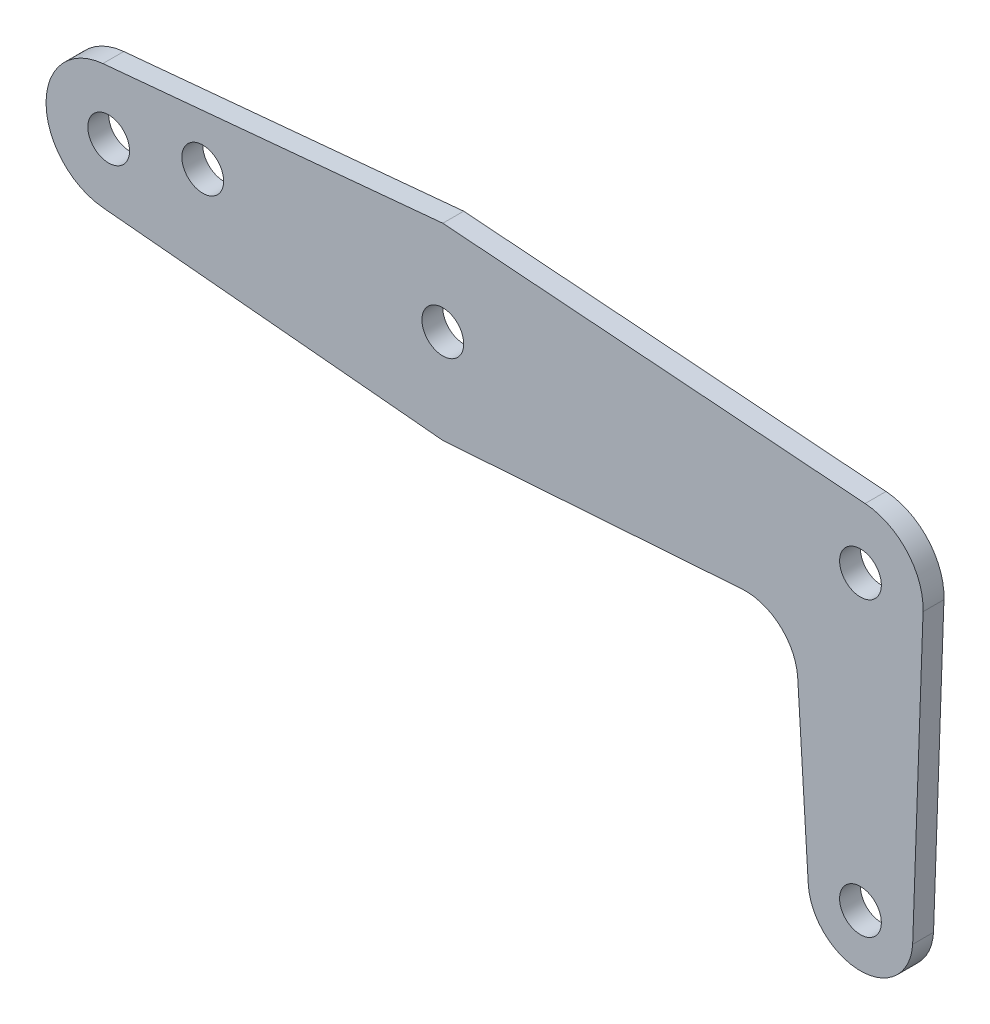
ISO-10303-21;
HEADER;
FILE_DESCRIPTION(('STEP AP214'),'2;1');
FILE_NAME('part.step','',(''),(''),'','','');
FILE_SCHEMA(('AUTOMOTIVE_DESIGN { 1 0 10303 214 1 1 1 1 }'));
ENDSEC;
DATA;
#1=APPLICATION_CONTEXT('core data for automotive mechanical design processes');
#2=APPLICATION_PROTOCOL_DEFINITION('international standard','automotive_design',2000,#1);
#3=PRODUCT_CONTEXT('',#1,'mechanical');
#4=PRODUCT('Part','Part','',(#3));
#5=PRODUCT_RELATED_PRODUCT_CATEGORY('part','',(#4));
#6=PRODUCT_DEFINITION_FORMATION('','',#4);
#7=PRODUCT_DEFINITION_CONTEXT('part definition',#1,'design');
#8=PRODUCT_DEFINITION('design','',#6,#7);
#9=PRODUCT_DEFINITION_SHAPE('','',#8);
#10=(LENGTH_UNIT() NAMED_UNIT(*) SI_UNIT(.MILLI.,.METRE.));
#11=(NAMED_UNIT(*) PLANE_ANGLE_UNIT() SI_UNIT($,.RADIAN.));
#12=(NAMED_UNIT(*) SI_UNIT($,.STERADIAN.) SOLID_ANGLE_UNIT());
#13=UNCERTAINTY_MEASURE_WITH_UNIT(LENGTH_MEASURE(1.E-05),#10,'distance_accuracy_value','');
#14=(GEOMETRIC_REPRESENTATION_CONTEXT(3) GLOBAL_UNCERTAINTY_ASSIGNED_CONTEXT((#13)) GLOBAL_UNIT_ASSIGNED_CONTEXT((#10,
#11,#12)) REPRESENTATION_CONTEXT('',''));
#15=CARTESIAN_POINT('',(0.,0.,0.));
#16=DIRECTION('',(0.,0.,1.));
#17=DIRECTION('',(1.,0.,0.));
#18=AXIS2_PLACEMENT_3D('',#15,#16,#17);
#19=CARTESIAN_POINT('',(-45.,0.,1.25));
#20=DIRECTION('',(0.,0.,1.));
#21=DIRECTION('',(1.,0.,0.));
#22=AXIS2_PLACEMENT_3D('',#19,#20,#21);
#23=PLANE('',#22);
#24=CARTESIAN_POINT('',(-25.,0.,1.25));
#25=DIRECTION('',(0.,0.,1.));
#26=DIRECTION('',(1.,0.,0.));
#27=AXIS2_PLACEMENT_3D('',#24,#25,#26);
#28=CIRCLE('',#27,1.25);
#29=CARTESIAN_POINT('',(-23.75,0.,1.25));
#30=VERTEX_POINT('',#29);
#31=EDGE_CURVE('E265',#30,#30,#28,.T.);
#32=ORIENTED_EDGE('',*,*,#31,.F.);
#33=EDGE_LOOP('',(#32));
#34=FACE_BOUND('',#33,.T.);
#35=CARTESIAN_POINT('',(0.,-17.5,1.25));
#36=DIRECTION('',(0.,0.,1.));
#37=DIRECTION('',(1.,0.,0.));
#38=AXIS2_PLACEMENT_3D('',#35,#36,#37);
#39=CIRCLE('',#38,1.25);
#40=CARTESIAN_POINT('',(1.25,-17.5,1.25));
#41=VERTEX_POINT('',#40);
#42=EDGE_CURVE('E249',#41,#41,#39,.T.);
#43=ORIENTED_EDGE('',*,*,#42,.F.);
#44=EDGE_LOOP('',(#43));
#45=FACE_BOUND('',#44,.T.);
#46=DIRECTION('',(-0.995686107734085,-0.0927856393271451,0.));
#47=VECTOR('',#46,1.);
#48=CARTESIAN_POINT('',(-25.,5.63,1.25));
#49=LINE('',#48,#47);
#50=CARTESIAN_POINT('',(-25.,5.63,1.25));
#51=VERTEX_POINT('',#50);
#52=CARTESIAN_POINT('',(-45.3479461474768,3.73382290400282,1.25));
#53=VERTEX_POINT('',#52);
#54=EDGE_CURVE('E182',#51,#53,#49,.T.);
#55=ORIENTED_EDGE('',*,*,#54,.T.);
#56=CARTESIAN_POINT('',(-45.,0.,1.25));
#57=DIRECTION('',(0.,0.,1.));
#58=DIRECTION('',(1.,0.,0.));
#59=AXIS2_PLACEMENT_3D('',#56,#57,#58);
#60=CIRCLE('',#59,3.75);
#61=CARTESIAN_POINT('',(-45.3479461474768,-3.73382290400282,1.25));
#62=VERTEX_POINT('',#61);
#63=EDGE_CURVE('E106',#53,#62,#60,.T.);
#64=ORIENTED_EDGE('',*,*,#63,.T.);
#65=DIRECTION('',(0.995686107734085,-0.0927856393271451,0.));
#66=VECTOR('',#65,1.);
#67=CARTESIAN_POINT('',(-25.,-5.63,1.25));
#68=LINE('',#67,#66);
#69=CARTESIAN_POINT('',(-25.,-5.63,1.25));
#70=VERTEX_POINT('',#69);
#71=EDGE_CURVE('E211',#62,#70,#68,.T.);
#72=ORIENTED_EDGE('',*,*,#71,.T.);
#73=DIRECTION('',(0.99756184215865,0.0697880438831856,0.));
#74=VECTOR('',#73,1.);
#75=CARTESIAN_POINT('',(-7.09843657735437,-4.37763143404343,1.25));
#76=LINE('',#75,#74);
#77=CARTESIAN_POINT('',(-7.09843657735437,-4.37763143404343,1.25));
#78=VERTEX_POINT('',#77);
#79=EDGE_CURVE('E231',#70,#78,#76,.T.);
#80=ORIENTED_EDGE('',*,*,#79,.T.);
#81=CARTESIAN_POINT('',(-6.88,-7.5,1.25));
#82=DIRECTION('',(0.,0.,-1.));
#83=DIRECTION('',(1.,0.,0.));
#84=AXIS2_PLACEMENT_3D('',#81,#82,#83);
#85=CIRCLE('',#84,3.13);
#86=CARTESIAN_POINT('',(-3.75577727989944,-7.30991476857082,1.25));
#87=VERTEX_POINT('',#86);
#88=EDGE_CURVE('E227',#78,#87,#85,.T.);
#89=ORIENTED_EDGE('',*,*,#88,.T.);
#90=DIRECTION('',(0.0607301058879179,-0.998154223674299,0.));
#91=VECTOR('',#90,1.);
#92=CARTESIAN_POINT('',(-3.12422272010055,-17.6900852314292,1.25));
#93=LINE('',#92,#91);
#94=CARTESIAN_POINT('',(-3.12422272010055,-17.6900852314292,1.25));
#95=VERTEX_POINT('',#94);
#96=EDGE_CURVE('E230',#87,#95,#93,.T.);
#97=ORIENTED_EDGE('',*,*,#96,.T.);
#98=CARTESIAN_POINT('',(0.,-17.5,1.25));
#99=DIRECTION('',(0.,0.,1.));
#100=DIRECTION('',(1.,0.,0.));
#101=AXIS2_PLACEMENT_3D('',#98,#99,#100);
#102=CIRCLE('',#101,3.13);
#103=CARTESIAN_POINT('',(3.12422272010056,-17.6900852314292,1.25));
#104=VERTEX_POINT('',#103);
#105=EDGE_CURVE('E131',#95,#104,#102,.T.);
#106=ORIENTED_EDGE('',*,*,#105,.T.);
#107=DIRECTION('',(0.0354856947205219,0.999370184401257,0.));
#108=VECTOR('',#107,1.);
#109=CARTESIAN_POINT('',(3.12422272010056,-17.6900852314292,1.25));
#110=LINE('',#109,#108);
#111=CARTESIAN_POINT('',(3.74763819150471,-0.133071355201956,1.25));
#112=VERTEX_POINT('',#111);
#113=EDGE_CURVE('E125',#104,#112,#110,.T.);
#114=ORIENTED_EDGE('',*,*,#113,.T.);
#115=CARTESIAN_POINT('',(0.,0.,1.25));
#116=DIRECTION('',(0.,0.,1.));
#117=DIRECTION('',(-1.,0.,0.));
#118=AXIS2_PLACEMENT_3D('',#115,#116,#117);
#119=CIRCLE('',#118,3.75);
#120=CARTESIAN_POINT('',(0.279648541627755,3.73955835536303,1.25));
#121=VERTEX_POINT('',#120);
#122=EDGE_CURVE('E129',#112,#121,#119,.T.);
#123=ORIENTED_EDGE('',*,*,#122,.T.);
#124=DIRECTION('',(-0.997215561430142,0.074572944434068,0.));
#125=VECTOR('',#124,1.);
#126=CARTESIAN_POINT('',(0.279648541627755,3.73955835536303,1.25));
#127=LINE('',#126,#125);
#128=EDGE_CURVE('E57',#121,#51,#127,.T.);
#129=ORIENTED_EDGE('',*,*,#128,.T.);
#130=EDGE_LOOP('',(#55,#64,#72,#80,#89,#97,#106,#114,#123,#129));
#131=FACE_BOUND('',#130,.T.);
#132=CARTESIAN_POINT('',(0.,0.,1.25));
#133=DIRECTION('',(0.,0.,1.));
#134=DIRECTION('',(1.,0.,0.));
#135=AXIS2_PLACEMENT_3D('',#132,#133,#134);
#136=CIRCLE('',#135,1.25);
#137=CARTESIAN_POINT('',(1.25,0.,1.25));
#138=VERTEX_POINT('',#137);
#139=EDGE_CURVE('E158',#138,#138,#136,.T.);
#140=ORIENTED_EDGE('',*,*,#139,.F.);
#141=EDGE_LOOP('',(#140));
#142=FACE_BOUND('',#141,.T.);
#143=CARTESIAN_POINT('',(-45.,0.,1.25));
#144=DIRECTION('',(0.,0.,1.));
#145=DIRECTION('',(1.,0.,0.));
#146=AXIS2_PLACEMENT_3D('',#143,#144,#145);
#147=CIRCLE('',#146,1.25);
#148=CARTESIAN_POINT('',(-43.75,0.,1.25));
#149=VERTEX_POINT('',#148);
#150=EDGE_CURVE('E257',#149,#149,#147,.T.);
#151=ORIENTED_EDGE('',*,*,#150,.F.);
#152=EDGE_LOOP('',(#151));
#153=FACE_BOUND('',#152,.T.);
#154=CARTESIAN_POINT('',(-39.37,1.25,1.25));
#155=DIRECTION('',(0.,0.,1.));
#156=DIRECTION('',(1.,0.,0.));
#157=AXIS2_PLACEMENT_3D('',#154,#155,#156);
#158=CIRCLE('',#157,1.25);
#159=CARTESIAN_POINT('',(-38.12,1.25,1.25));
#160=VERTEX_POINT('',#159);
#161=EDGE_CURVE('E273',#160,#160,#158,.T.);
#162=ORIENTED_EDGE('',*,*,#161,.F.);
#163=EDGE_LOOP('',(#162));
#164=FACE_BOUND('',#163,.T.);
#165=ADVANCED_FACE('F39',(#34,#45,#131,#142,#153,#164),#23,.T.);
#166=CARTESIAN_POINT('',(-45.,0.,0.));
#167=DIRECTION('',(0.,0.,1.));
#168=DIRECTION('',(1.,0.,0.));
#169=AXIS2_PLACEMENT_3D('',#166,#167,#168);
#170=PLANE('',#169);
#171=DIRECTION('',(-0.995686107734085,-0.0927856393271451,0.));
#172=VECTOR('',#171,1.);
#173=CARTESIAN_POINT('',(-25.,5.63,0.));
#174=LINE('',#173,#172);
#175=CARTESIAN_POINT('',(-25.,5.63,0.));
#176=VERTEX_POINT('',#175);
#177=CARTESIAN_POINT('',(-45.3479461474768,3.73382290400282,0.));
#178=VERTEX_POINT('',#177);
#179=EDGE_CURVE('E153',#176,#178,#174,.T.);
#180=ORIENTED_EDGE('',*,*,#179,.F.);
#181=DIRECTION('',(-0.997215561430142,0.074572944434068,0.));
#182=VECTOR('',#181,1.);
#183=CARTESIAN_POINT('',(0.279648541627755,3.73955835536303,0.));
#184=LINE('',#183,#182);
#185=CARTESIAN_POINT('',(0.279648541627755,3.73955835536303,0.));
#186=VERTEX_POINT('',#185);
#187=EDGE_CURVE('E98',#186,#176,#184,.T.);
#188=ORIENTED_EDGE('',*,*,#187,.F.);
#189=CARTESIAN_POINT('',(0.,0.,0.));
#190=DIRECTION('',(0.,0.,1.));
#191=DIRECTION('',(-1.,0.,0.));
#192=AXIS2_PLACEMENT_3D('',#189,#190,#191);
#193=CIRCLE('',#192,3.75);
#194=CARTESIAN_POINT('',(3.74763819150471,-0.133071355201956,0.));
#195=VERTEX_POINT('',#194);
#196=EDGE_CURVE('E92',#195,#186,#193,.T.);
#197=ORIENTED_EDGE('',*,*,#196,.F.);
#198=DIRECTION('',(0.0354856947205219,0.999370184401257,0.));
#199=VECTOR('',#198,1.);
#200=CARTESIAN_POINT('',(3.12422272010056,-17.6900852314292,0.));
#201=LINE('',#200,#199);
#202=CARTESIAN_POINT('',(3.12422272010056,-17.6900852314292,0.));
#203=VERTEX_POINT('',#202);
#204=EDGE_CURVE('E140',#203,#195,#201,.T.);
#205=ORIENTED_EDGE('',*,*,#204,.F.);
#206=CARTESIAN_POINT('',(0.,-17.5,0.));
#207=DIRECTION('',(0.,0.,1.));
#208=DIRECTION('',(1.,0.,0.));
#209=AXIS2_PLACEMENT_3D('',#206,#207,#208);
#210=CIRCLE('',#209,3.13);
#211=CARTESIAN_POINT('',(-3.12422272010055,-17.6900852314292,0.));
#212=VERTEX_POINT('',#211);
#213=EDGE_CURVE('E173',#212,#203,#210,.T.);
#214=ORIENTED_EDGE('',*,*,#213,.F.);
#215=DIRECTION('',(0.0607301058879179,-0.998154223674299,0.));
#216=VECTOR('',#215,1.);
#217=CARTESIAN_POINT('',(-3.12422272010055,-17.6900852314292,0.));
#218=LINE('',#217,#216);
#219=CARTESIAN_POINT('',(-3.75577727989944,-7.30991476857082,0.));
#220=VERTEX_POINT('',#219);
#221=EDGE_CURVE('E170',#220,#212,#218,.T.);
#222=ORIENTED_EDGE('',*,*,#221,.F.);
#223=CARTESIAN_POINT('',(-6.88,-7.5,0.));
#224=DIRECTION('',(0.,0.,-1.));
#225=DIRECTION('',(1.,0.,0.));
#226=AXIS2_PLACEMENT_3D('',#223,#224,#225);
#227=CIRCLE('',#226,3.13);
#228=CARTESIAN_POINT('',(-7.09843657735437,-4.37763143404343,0.));
#229=VERTEX_POINT('',#228);
#230=EDGE_CURVE('E167',#229,#220,#227,.T.);
#231=ORIENTED_EDGE('',*,*,#230,.F.);
#232=DIRECTION('',(0.99756184215865,0.0697880438831856,0.));
#233=VECTOR('',#232,1.);
#234=CARTESIAN_POINT('',(-7.09843657735437,-4.37763143404343,0.));
#235=LINE('',#234,#233);
#236=CARTESIAN_POINT('',(-25.,-5.63,0.));
#237=VERTEX_POINT('',#236);
#238=EDGE_CURVE('E164',#237,#229,#235,.T.);
#239=ORIENTED_EDGE('',*,*,#238,.F.);
#240=DIRECTION('',(0.995686107734085,-0.0927856393271451,0.));
#241=VECTOR('',#240,1.);
#242=CARTESIAN_POINT('',(-25.,-5.63,0.));
#243=LINE('',#242,#241);
#244=CARTESIAN_POINT('',(-45.3479461474768,-3.73382290400282,0.));
#245=VERTEX_POINT('',#244);
#246=EDGE_CURVE('E161',#245,#237,#243,.T.);
#247=ORIENTED_EDGE('',*,*,#246,.F.);
#248=CARTESIAN_POINT('',(-45.,0.,0.));
#249=DIRECTION('',(0.,0.,1.));
#250=DIRECTION('',(1.,0.,0.));
#251=AXIS2_PLACEMENT_3D('',#248,#249,#250);
#252=CIRCLE('',#251,3.75);
#253=EDGE_CURVE('E157',#178,#245,#252,.T.);
#254=ORIENTED_EDGE('',*,*,#253,.F.);
#255=EDGE_LOOP('',(#180,#188,#197,#205,#214,#222,#231,#239,#247,#254));
#256=FACE_BOUND('',#255,.T.);
#257=CARTESIAN_POINT('',(0.,0.,0.));
#258=DIRECTION('',(0.,0.,1.));
#259=DIRECTION('',(1.,0.,0.));
#260=AXIS2_PLACEMENT_3D('',#257,#258,#259);
#261=CIRCLE('',#260,1.25);
#262=CARTESIAN_POINT('',(1.25,0.,0.));
#263=VERTEX_POINT('',#262);
#264=EDGE_CURVE('E245',#263,#263,#261,.T.);
#265=ORIENTED_EDGE('',*,*,#264,.T.);
#266=EDGE_LOOP('',(#265));
#267=FACE_BOUND('',#266,.T.);
#268=CARTESIAN_POINT('',(0.,-17.5,0.));
#269=DIRECTION('',(0.,0.,1.));
#270=DIRECTION('',(1.,0.,0.));
#271=AXIS2_PLACEMENT_3D('',#268,#269,#270);
#272=CIRCLE('',#271,1.25);
#273=CARTESIAN_POINT('',(1.25,-17.5,0.));
#274=VERTEX_POINT('',#273);
#275=EDGE_CURVE('E253',#274,#274,#272,.T.);
#276=ORIENTED_EDGE('',*,*,#275,.T.);
#277=EDGE_LOOP('',(#276));
#278=FACE_BOUND('',#277,.T.);
#279=CARTESIAN_POINT('',(-45.,0.,0.));
#280=DIRECTION('',(0.,0.,1.));
#281=DIRECTION('',(1.,0.,0.));
#282=AXIS2_PLACEMENT_3D('',#279,#280,#281);
#283=CIRCLE('',#282,1.25);
#284=CARTESIAN_POINT('',(-43.75,0.,0.));
#285=VERTEX_POINT('',#284);
#286=EDGE_CURVE('E261',#285,#285,#283,.T.);
#287=ORIENTED_EDGE('',*,*,#286,.T.);
#288=EDGE_LOOP('',(#287));
#289=FACE_BOUND('',#288,.T.);
#290=CARTESIAN_POINT('',(-25.,0.,0.));
#291=DIRECTION('',(0.,0.,1.));
#292=DIRECTION('',(1.,0.,0.));
#293=AXIS2_PLACEMENT_3D('',#290,#291,#292);
#294=CIRCLE('',#293,1.25);
#295=CARTESIAN_POINT('',(-23.75,0.,0.));
#296=VERTEX_POINT('',#295);
#297=EDGE_CURVE('E269',#296,#296,#294,.T.);
#298=ORIENTED_EDGE('',*,*,#297,.T.);
#299=EDGE_LOOP('',(#298));
#300=FACE_BOUND('',#299,.T.);
#301=CARTESIAN_POINT('',(-39.37,1.25,0.));
#302=DIRECTION('',(0.,0.,1.));
#303=DIRECTION('',(1.,0.,0.));
#304=AXIS2_PLACEMENT_3D('',#301,#302,#303);
#305=CIRCLE('',#304,1.25);
#306=CARTESIAN_POINT('',(-38.12,1.25,0.));
#307=VERTEX_POINT('',#306);
#308=EDGE_CURVE('E277',#307,#307,#305,.T.);
#309=ORIENTED_EDGE('',*,*,#308,.T.);
#310=EDGE_LOOP('',(#309));
#311=FACE_BOUND('',#310,.T.);
#312=ADVANCED_FACE('F215',(#256,#267,#278,#289,#300,#311),#170,.F.);
#313=CARTESIAN_POINT('',(-25.,5.63,1.25));
#314=DIRECTION('',(0.0927856393271451,-0.995686107734086,0.));
#315=DIRECTION('',(0.995686107734086,0.0927856393271451,0.));
#316=AXIS2_PLACEMENT_3D('',#313,#314,#315);
#317=PLANE('',#316);
#318=ORIENTED_EDGE('',*,*,#179,.T.);
#319=DIRECTION('',(0.,0.,-1.));
#320=VECTOR('',#319,1.);
#321=CARTESIAN_POINT('',(-45.3479461474768,3.73382290400282,1.25));
#322=LINE('',#321,#320);
#323=EDGE_CURVE('E11',#53,#178,#322,.T.);
#324=ORIENTED_EDGE('',*,*,#323,.F.);
#325=ORIENTED_EDGE('',*,*,#54,.F.);
#326=DIRECTION('',(0.,0.,-1.));
#327=VECTOR('',#326,1.);
#328=CARTESIAN_POINT('',(-25.,5.63,1.25));
#329=LINE('',#328,#327);
#330=EDGE_CURVE('E149',#51,#176,#329,.T.);
#331=ORIENTED_EDGE('',*,*,#330,.T.);
#332=EDGE_LOOP('',(#318,#324,#325,#331));
#333=FACE_BOUND('',#332,.T.);
#334=ADVANCED_FACE('F41',(#333),#317,.F.);
#335=CARTESIAN_POINT('',(-45.,0.,1.25));
#336=DIRECTION('',(0.,0.,-1.));
#337=DIRECTION('',(-1.,0.,0.));
#338=AXIS2_PLACEMENT_3D('',#335,#336,#337);
#339=CYLINDRICAL_SURFACE('',#338,3.75);
#340=ORIENTED_EDGE('',*,*,#253,.T.);
#341=DIRECTION('',(0.,0.,-1.));
#342=VECTOR('',#341,1.);
#343=CARTESIAN_POINT('',(-45.3479461474768,-3.73382290400282,1.25));
#344=LINE('',#343,#342);
#345=EDGE_CURVE('E49',#62,#245,#344,.T.);
#346=ORIENTED_EDGE('',*,*,#345,.F.);
#347=ORIENTED_EDGE('',*,*,#63,.F.);
#348=ORIENTED_EDGE('',*,*,#323,.T.);
#349=EDGE_LOOP('',(#340,#346,#347,#348));
#350=FACE_BOUND('',#349,.T.);
#351=ADVANCED_FACE('F321',(#350),#339,.T.);
#352=CARTESIAN_POINT('',(-25.,-5.63,1.25));
#353=DIRECTION('',(0.0927856393271451,0.995686107734086,0.));
#354=DIRECTION('',(-0.995686107734086,0.0927856393271451,0.));
#355=AXIS2_PLACEMENT_3D('',#352,#353,#354);
#356=PLANE('',#355);
#357=ORIENTED_EDGE('',*,*,#246,.T.);
#358=DIRECTION('',(0.,0.,-1.));
#359=VECTOR('',#358,1.);
#360=CARTESIAN_POINT('',(-25.,-5.63,1.25));
#361=LINE('',#360,#359);
#362=EDGE_CURVE('E201',#70,#237,#361,.T.);
#363=ORIENTED_EDGE('',*,*,#362,.F.);
#364=ORIENTED_EDGE('',*,*,#71,.F.);
#365=ORIENTED_EDGE('',*,*,#345,.T.);
#366=EDGE_LOOP('',(#357,#363,#364,#365));
#367=FACE_BOUND('',#366,.T.);
#368=ADVANCED_FACE('F209',(#367),#356,.F.);
#369=CARTESIAN_POINT('',(-7.09843657735437,-4.37763143404343,1.25));
#370=DIRECTION('',(-0.0697880438831856,0.99756184215865,0.));
#371=DIRECTION('',(-0.99756184215865,-0.0697880438831856,0.));
#372=AXIS2_PLACEMENT_3D('',#369,#370,#371);
#373=PLANE('',#372);
#374=ORIENTED_EDGE('',*,*,#238,.T.);
#375=DIRECTION('',(0.,0.,-1.));
#376=VECTOR('',#375,1.);
#377=CARTESIAN_POINT('',(-7.09843657735437,-4.37763143404343,1.25));
#378=LINE('',#377,#376);
#379=EDGE_CURVE('E197',#78,#229,#378,.T.);
#380=ORIENTED_EDGE('',*,*,#379,.F.);
#381=ORIENTED_EDGE('',*,*,#79,.F.);
#382=ORIENTED_EDGE('',*,*,#362,.T.);
#383=EDGE_LOOP('',(#374,#380,#381,#382));
#384=FACE_BOUND('',#383,.T.);
#385=ADVANCED_FACE('F221',(#384),#373,.F.);
#386=CARTESIAN_POINT('',(-6.88,-7.5,1.25));
#387=DIRECTION('',(0.,0.,-1.));
#388=DIRECTION('',(-1.,0.,0.));
#389=AXIS2_PLACEMENT_3D('',#386,#387,#388);
#390=CYLINDRICAL_SURFACE('',#389,3.13);
#391=ORIENTED_EDGE('',*,*,#230,.T.);
#392=DIRECTION('',(0.,0.,-1.));
#393=VECTOR('',#392,1.);
#394=CARTESIAN_POINT('',(-3.75577727989944,-7.30991476857082,1.25));
#395=LINE('',#394,#393);
#396=EDGE_CURVE('E193',#87,#220,#395,.T.);
#397=ORIENTED_EDGE('',*,*,#396,.F.);
#398=ORIENTED_EDGE('',*,*,#88,.F.);
#399=ORIENTED_EDGE('',*,*,#379,.T.);
#400=EDGE_LOOP('',(#391,#397,#398,#399));
#401=FACE_BOUND('',#400,.T.);
#402=ADVANCED_FACE('F225',(#401),#390,.F.);
#403=CARTESIAN_POINT('',(-3.12422272010055,-17.6900852314292,1.25));
#404=DIRECTION('',(0.998154223674299,0.0607301058879179,0.));
#405=DIRECTION('',(-0.0607301058879179,0.998154223674299,0.));
#406=AXIS2_PLACEMENT_3D('',#403,#404,#405);
#407=PLANE('',#406);
#408=ORIENTED_EDGE('',*,*,#221,.T.);
#409=DIRECTION('',(0.,0.,-1.));
#410=VECTOR('',#409,1.);
#411=CARTESIAN_POINT('',(-3.12422272010055,-17.6900852314292,1.25));
#412=LINE('',#411,#410);
#413=EDGE_CURVE('E189',#95,#212,#412,.T.);
#414=ORIENTED_EDGE('',*,*,#413,.F.);
#415=ORIENTED_EDGE('',*,*,#96,.F.);
#416=ORIENTED_EDGE('',*,*,#396,.T.);
#417=EDGE_LOOP('',(#408,#414,#415,#416));
#418=FACE_BOUND('',#417,.T.);
#419=ADVANCED_FACE('F311',(#418),#407,.F.);
#420=CARTESIAN_POINT('',(0.,-17.5,1.25));
#421=DIRECTION('',(0.,0.,-1.));
#422=DIRECTION('',(-1.,0.,0.));
#423=AXIS2_PLACEMENT_3D('',#420,#421,#422);
#424=CYLINDRICAL_SURFACE('',#423,3.13);
#425=ORIENTED_EDGE('',*,*,#213,.T.);
#426=DIRECTION('',(0.,0.,-1.));
#427=VECTOR('',#426,1.);
#428=CARTESIAN_POINT('',(3.12422272010056,-17.6900852314292,1.25));
#429=LINE('',#428,#427);
#430=EDGE_CURVE('E142',#104,#203,#429,.T.);
#431=ORIENTED_EDGE('',*,*,#430,.F.);
#432=ORIENTED_EDGE('',*,*,#105,.F.);
#433=ORIENTED_EDGE('',*,*,#413,.T.);
#434=EDGE_LOOP('',(#425,#431,#432,#433));
#435=FACE_BOUND('',#434,.T.);
#436=ADVANCED_FACE('F308',(#435),#424,.T.);
#437=CARTESIAN_POINT('',(3.12422272010056,-17.6900852314292,1.25));
#438=DIRECTION('',(-0.999370184401257,0.0354856947205219,0.));
#439=DIRECTION('',(-0.0354856947205219,-0.999370184401257,0.));
#440=AXIS2_PLACEMENT_3D('',#437,#438,#439);
#441=PLANE('',#440);
#442=ORIENTED_EDGE('',*,*,#204,.T.);
#443=DIRECTION('',(0.,0.,-1.));
#444=VECTOR('',#443,1.);
#445=CARTESIAN_POINT('',(3.74763819150471,-0.133071355201956,1.25));
#446=LINE('',#445,#444);
#447=EDGE_CURVE('E137',#112,#195,#446,.T.);
#448=ORIENTED_EDGE('',*,*,#447,.F.);
#449=ORIENTED_EDGE('',*,*,#113,.F.);
#450=ORIENTED_EDGE('',*,*,#430,.T.);
#451=EDGE_LOOP('',(#442,#448,#449,#450));
#452=FACE_BOUND('',#451,.T.);
#453=ADVANCED_FACE('F138',(#452),#441,.F.);
#454=CARTESIAN_POINT('',(0.,0.,1.25));
#455=DIRECTION('',(0.,0.,-1.));
#456=DIRECTION('',(-1.,0.,0.));
#457=AXIS2_PLACEMENT_3D('',#454,#455,#456);
#458=CYLINDRICAL_SURFACE('',#457,3.75);
#459=ORIENTED_EDGE('',*,*,#196,.T.);
#460=DIRECTION('',(0.,0.,-1.));
#461=VECTOR('',#460,1.);
#462=CARTESIAN_POINT('',(0.279648541627755,3.73955835536303,1.25));
#463=LINE('',#462,#461);
#464=EDGE_CURVE('E143',#121,#186,#463,.T.);
#465=ORIENTED_EDGE('',*,*,#464,.F.);
#466=ORIENTED_EDGE('',*,*,#122,.F.);
#467=ORIENTED_EDGE('',*,*,#447,.T.);
#468=EDGE_LOOP('',(#459,#465,#466,#467));
#469=FACE_BOUND('',#468,.T.);
#470=ADVANCED_FACE('F145',(#469),#458,.T.);
#471=CARTESIAN_POINT('',(0.279648541627755,3.73955835536303,1.25));
#472=DIRECTION('',(-0.074572944434068,-0.997215561430142,0.));
#473=DIRECTION('',(0.997215561430142,-0.074572944434068,0.));
#474=AXIS2_PLACEMENT_3D('',#471,#472,#473);
#475=PLANE('',#474);
#476=ORIENTED_EDGE('',*,*,#187,.T.);
#477=ORIENTED_EDGE('',*,*,#330,.F.);
#478=ORIENTED_EDGE('',*,*,#128,.F.);
#479=ORIENTED_EDGE('',*,*,#464,.T.);
#480=EDGE_LOOP('',(#476,#477,#478,#479));
#481=FACE_BOUND('',#480,.T.);
#482=ADVANCED_FACE('F301',(#481),#475,.F.);
#483=CARTESIAN_POINT('',(0.,0.,1.25));
#484=DIRECTION('',(0.,0.,-1.));
#485=DIRECTION('',(-1.,0.,0.));
#486=AXIS2_PLACEMENT_3D('',#483,#484,#485);
#487=CYLINDRICAL_SURFACE('',#486,1.25);
#488=ORIENTED_EDGE('',*,*,#139,.T.);
#489=EDGE_LOOP('',(#488));
#490=FACE_BOUND('',#489,.T.);
#491=ORIENTED_EDGE('',*,*,#264,.F.);
#492=EDGE_LOOP('',(#491));
#493=FACE_BOUND('',#492,.T.);
#494=ADVANCED_FACE('F298',(#490,#493),#487,.F.);
#495=CARTESIAN_POINT('',(0.,-17.5,1.25));
#496=DIRECTION('',(0.,0.,-1.));
#497=DIRECTION('',(-1.,0.,0.));
#498=AXIS2_PLACEMENT_3D('',#495,#496,#497);
#499=CYLINDRICAL_SURFACE('',#498,1.25);
#500=ORIENTED_EDGE('',*,*,#42,.T.);
#501=EDGE_LOOP('',(#500));
#502=FACE_BOUND('',#501,.T.);
#503=ORIENTED_EDGE('',*,*,#275,.F.);
#504=EDGE_LOOP('',(#503));
#505=FACE_BOUND('',#504,.T.);
#506=ADVANCED_FACE('F397',(#502,#505),#499,.F.);
#507=CARTESIAN_POINT('',(-45.,0.,1.25));
#508=DIRECTION('',(0.,0.,-1.));
#509=DIRECTION('',(-1.,0.,0.));
#510=AXIS2_PLACEMENT_3D('',#507,#508,#509);
#511=CYLINDRICAL_SURFACE('',#510,1.25);
#512=ORIENTED_EDGE('',*,*,#150,.T.);
#513=EDGE_LOOP('',(#512));
#514=FACE_BOUND('',#513,.T.);
#515=ORIENTED_EDGE('',*,*,#286,.F.);
#516=EDGE_LOOP('',(#515));
#517=FACE_BOUND('',#516,.T.);
#518=ADVANCED_FACE('F405',(#514,#517),#511,.F.);
#519=CARTESIAN_POINT('',(-25.,0.,1.25));
#520=DIRECTION('',(0.,0.,-1.));
#521=DIRECTION('',(-1.,0.,0.));
#522=AXIS2_PLACEMENT_3D('',#519,#520,#521);
#523=CYLINDRICAL_SURFACE('',#522,1.25);
#524=ORIENTED_EDGE('',*,*,#31,.T.);
#525=EDGE_LOOP('',(#524));
#526=FACE_BOUND('',#525,.T.);
#527=ORIENTED_EDGE('',*,*,#297,.F.);
#528=EDGE_LOOP('',(#527));
#529=FACE_BOUND('',#528,.T.);
#530=ADVANCED_FACE('F413',(#526,#529),#523,.F.);
#531=CARTESIAN_POINT('',(-39.37,1.25,1.25));
#532=DIRECTION('',(0.,0.,-1.));
#533=DIRECTION('',(-1.,0.,0.));
#534=AXIS2_PLACEMENT_3D('',#531,#532,#533);
#535=CYLINDRICAL_SURFACE('',#534,1.25);
#536=ORIENTED_EDGE('',*,*,#161,.T.);
#537=EDGE_LOOP('',(#536));
#538=FACE_BOUND('',#537,.T.);
#539=ORIENTED_EDGE('',*,*,#308,.F.);
#540=EDGE_LOOP('',(#539));
#541=FACE_BOUND('',#540,.T.);
#542=ADVANCED_FACE('F285',(#538,#541),#535,.F.);
#543=CLOSED_SHELL('',(#165,#312,#334,#351,#368,#385,#402,#419,#436,#453,#470,#482,#494,#506,
#518,#530,#542));
#544=MANIFOLD_SOLID_BREP('B2',#543);
#545=ADVANCED_BREP_SHAPE_REPRESENTATION('',(#18,#544),#14);
#546=SHAPE_DEFINITION_REPRESENTATION(#9,#545);
ENDSEC;
END-ISO-10303-21;
